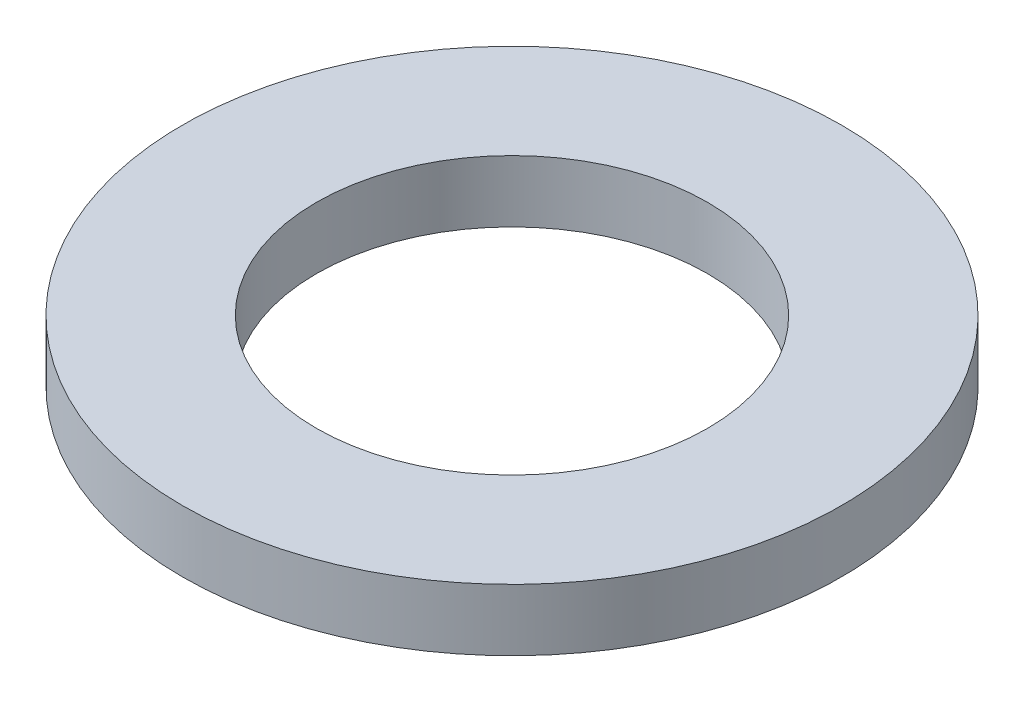
ISO-10303-21;
HEADER;
FILE_DESCRIPTION(('STEP AP214'),'2;1');
FILE_NAME('part.step','',(''),(''),'','','');
FILE_SCHEMA(('AUTOMOTIVE_DESIGN { 1 0 10303 214 1 1 1 1 }'));
ENDSEC;
DATA;
#1=APPLICATION_CONTEXT('core data for automotive mechanical design processes');
#2=APPLICATION_PROTOCOL_DEFINITION('international standard','automotive_design',2000,#1);
#3=PRODUCT_CONTEXT('',#1,'mechanical');
#4=PRODUCT('Part','Part','',(#3));
#5=PRODUCT_RELATED_PRODUCT_CATEGORY('part','',(#4));
#6=PRODUCT_DEFINITION_FORMATION('','',#4);
#7=PRODUCT_DEFINITION_CONTEXT('part definition',#1,'design');
#8=PRODUCT_DEFINITION('design','',#6,#7);
#9=PRODUCT_DEFINITION_SHAPE('','',#8);
#10=(LENGTH_UNIT() NAMED_UNIT(*) SI_UNIT(.MILLI.,.METRE.));
#11=(NAMED_UNIT(*) PLANE_ANGLE_UNIT() SI_UNIT($,.RADIAN.));
#12=(NAMED_UNIT(*) SI_UNIT($,.STERADIAN.) SOLID_ANGLE_UNIT());
#13=UNCERTAINTY_MEASURE_WITH_UNIT(LENGTH_MEASURE(1.E-05),#10,'distance_accuracy_value','');
#14=(GEOMETRIC_REPRESENTATION_CONTEXT(3) GLOBAL_UNCERTAINTY_ASSIGNED_CONTEXT((#13)) GLOBAL_UNIT_ASSIGNED_CONTEXT((#10,
#11,#12)) REPRESENTATION_CONTEXT('',''));
#15=CARTESIAN_POINT('',(0.,0.,0.));
#16=DIRECTION('',(0.,0.,1.));
#17=DIRECTION('',(1.,0.,0.));
#18=AXIS2_PLACEMENT_3D('',#15,#16,#17);
#19=CARTESIAN_POINT('',(0.,15.,0.));
#20=DIRECTION('',(0.,-1.,0.));
#21=DIRECTION('',(0.,0.,-1.));
#22=AXIS2_PLACEMENT_3D('',#19,#20,#21);
#23=CYLINDRICAL_SURFACE('',#22,80.);
#24=CARTESIAN_POINT('',(0.,15.,0.));
#25=DIRECTION('',(0.,1.,0.));
#26=DIRECTION('',(0.,0.,1.));
#27=AXIS2_PLACEMENT_3D('',#24,#25,#26);
#28=CIRCLE('',#27,80.);
#29=CARTESIAN_POINT('',(0.,15.,80.));
#30=VERTEX_POINT('',#29);
#31=EDGE_CURVE('E10',#30,#30,#28,.T.);
#32=ORIENTED_EDGE('',*,*,#31,.F.);
#33=EDGE_LOOP('',(#32));
#34=FACE_BOUND('',#33,.T.);
#35=CARTESIAN_POINT('',(0.,0.,0.));
#36=DIRECTION('',(0.,1.,0.));
#37=DIRECTION('',(0.,0.,1.));
#38=AXIS2_PLACEMENT_3D('',#35,#36,#37);
#39=CIRCLE('',#38,80.);
#40=CARTESIAN_POINT('',(0.,0.,80.));
#41=VERTEX_POINT('',#40);
#42=EDGE_CURVE('E37',#41,#41,#39,.T.);
#43=ORIENTED_EDGE('',*,*,#42,.T.);
#44=EDGE_LOOP('',(#43));
#45=FACE_BOUND('',#44,.T.);
#46=ADVANCED_FACE('F40',(#34,#45),#23,.T.);
#47=CARTESIAN_POINT('',(0.,15.,0.));
#48=DIRECTION('',(0.,1.,0.));
#49=DIRECTION('',(0.,0.,1.));
#50=AXIS2_PLACEMENT_3D('',#47,#48,#49);
#51=PLANE('',#50);
#52=CARTESIAN_POINT('',(0.,15.,0.));
#53=DIRECTION('',(0.,1.,0.));
#54=DIRECTION('',(0.,0.,1.));
#55=AXIS2_PLACEMENT_3D('',#52,#53,#54);
#56=CIRCLE('',#55,47.5);
#57=CARTESIAN_POINT('',(0.,15.,47.5));
#58=VERTEX_POINT('',#57);
#59=EDGE_CURVE('E50',#58,#58,#56,.T.);
#60=ORIENTED_EDGE('',*,*,#59,.F.);
#61=EDGE_LOOP('',(#60));
#62=FACE_BOUND('',#61,.T.);
#63=ORIENTED_EDGE('',*,*,#31,.T.);
#64=EDGE_LOOP('',(#63));
#65=FACE_BOUND('',#64,.T.);
#66=ADVANCED_FACE('F59',(#62,#65),#51,.T.);
#67=CARTESIAN_POINT('',(0.,0.,0.));
#68=DIRECTION('',(0.,1.,0.));
#69=DIRECTION('',(0.,0.,1.));
#70=AXIS2_PLACEMENT_3D('',#67,#68,#69);
#71=PLANE('',#70);
#72=CARTESIAN_POINT('',(0.,0.,0.));
#73=DIRECTION('',(0.,1.,0.));
#74=DIRECTION('',(0.,0.,1.));
#75=AXIS2_PLACEMENT_3D('',#72,#73,#74);
#76=CIRCLE('',#75,47.5);
#77=CARTESIAN_POINT('',(0.,0.,47.5));
#78=VERTEX_POINT('',#77);
#79=EDGE_CURVE('E47',#78,#78,#76,.T.);
#80=ORIENTED_EDGE('',*,*,#79,.T.);
#81=EDGE_LOOP('',(#80));
#82=FACE_BOUND('',#81,.T.);
#83=ORIENTED_EDGE('',*,*,#42,.F.);
#84=EDGE_LOOP('',(#83));
#85=FACE_BOUND('',#84,.T.);
#86=ADVANCED_FACE('F58',(#82,#85),#71,.F.);
#87=CARTESIAN_POINT('',(0.,15.,0.));
#88=DIRECTION('',(0.,-1.,0.));
#89=DIRECTION('',(0.,0.,-1.));
#90=AXIS2_PLACEMENT_3D('',#87,#88,#89);
#91=CYLINDRICAL_SURFACE('',#90,47.5);
#92=ORIENTED_EDGE('',*,*,#59,.T.);
#93=EDGE_LOOP('',(#92));
#94=FACE_BOUND('',#93,.T.);
#95=ORIENTED_EDGE('',*,*,#79,.F.);
#96=EDGE_LOOP('',(#95));
#97=FACE_BOUND('',#96,.T.);
#98=ADVANCED_FACE('F54',(#94,#97),#91,.F.);
#99=CLOSED_SHELL('',(#46,#66,#86,#98));
#100=MANIFOLD_SOLID_BREP('B2',#99);
#101=ADVANCED_BREP_SHAPE_REPRESENTATION('',(#18,#100),#14);
#102=SHAPE_DEFINITION_REPRESENTATION(#9,#101);
ENDSEC;
END-ISO-10303-21;
